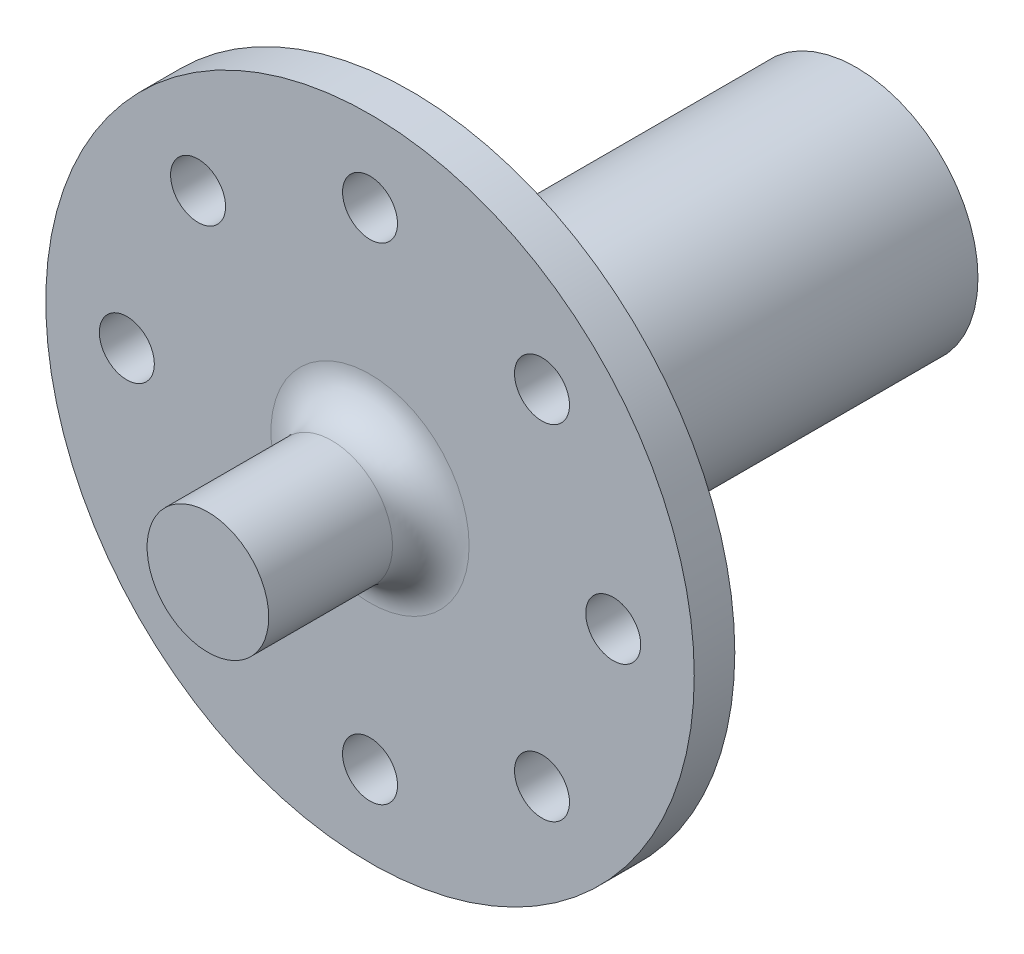
ISO-10303-21;
HEADER;
FILE_DESCRIPTION(('STEP AP214'),'2;1');
FILE_NAME('part.step','',(''),(''),'','','');
FILE_SCHEMA(('AUTOMOTIVE_DESIGN { 1 0 10303 214 1 1 1 1 }'));
ENDSEC;
DATA;
#1=APPLICATION_CONTEXT('core data for automotive mechanical design processes');
#2=APPLICATION_PROTOCOL_DEFINITION('international standard','automotive_design',2000,#1);
#3=PRODUCT_CONTEXT('',#1,'mechanical');
#4=PRODUCT('Part','Part','',(#3));
#5=PRODUCT_RELATED_PRODUCT_CATEGORY('part','',(#4));
#6=PRODUCT_DEFINITION_FORMATION('','',#4);
#7=PRODUCT_DEFINITION_CONTEXT('part definition',#1,'design');
#8=PRODUCT_DEFINITION('design','',#6,#7);
#9=PRODUCT_DEFINITION_SHAPE('','',#8);
#10=(LENGTH_UNIT() NAMED_UNIT(*) SI_UNIT(.MILLI.,.METRE.));
#11=(NAMED_UNIT(*) PLANE_ANGLE_UNIT() SI_UNIT($,.RADIAN.));
#12=(NAMED_UNIT(*) SI_UNIT($,.STERADIAN.) SOLID_ANGLE_UNIT());
#13=UNCERTAINTY_MEASURE_WITH_UNIT(LENGTH_MEASURE(1.E-05),#10,'distance_accuracy_value','');
#14=(GEOMETRIC_REPRESENTATION_CONTEXT(3) GLOBAL_UNCERTAINTY_ASSIGNED_CONTEXT((#13)) GLOBAL_UNIT_ASSIGNED_CONTEXT((#10,
#11,#12)) REPRESENTATION_CONTEXT('',''));
#15=CARTESIAN_POINT('',(0.,0.,0.));
#16=DIRECTION('',(0.,0.,1.));
#17=DIRECTION('',(1.,0.,0.));
#18=AXIS2_PLACEMENT_3D('',#15,#16,#17);
#19=CARTESIAN_POINT('',(0.,0.,34.925));
#20=DIRECTION('',(0.,0.,-1.));
#21=DIRECTION('',(-1.,0.,0.));
#22=AXIS2_PLACEMENT_3D('',#19,#20,#21);
#23=CYLINDRICAL_SURFACE('',#22,9.525);
#24=CARTESIAN_POINT('',(0.,0.,34.925));
#25=DIRECTION('',(0.,0.,1.));
#26=DIRECTION('',(1.,0.,0.));
#27=AXIS2_PLACEMENT_3D('',#24,#25,#26);
#28=CIRCLE('',#27,9.525);
#29=CARTESIAN_POINT('',(9.525,0.,34.925));
#30=VERTEX_POINT('',#29);
#31=EDGE_CURVE('E164',#30,#30,#28,.T.);
#32=ORIENTED_EDGE('',*,*,#31,.F.);
#33=EDGE_LOOP('',(#32));
#34=FACE_BOUND('',#33,.T.);
#35=CARTESIAN_POINT('',(0.,0.,0.));
#36=DIRECTION('',(0.,0.,1.));
#37=DIRECTION('',(1.,0.,0.));
#38=AXIS2_PLACEMENT_3D('',#35,#36,#37);
#39=CIRCLE('',#38,9.525);
#40=CARTESIAN_POINT('',(9.525,0.,0.));
#41=VERTEX_POINT('',#40);
#42=EDGE_CURVE('E161',#41,#41,#39,.T.);
#43=ORIENTED_EDGE('',*,*,#42,.T.);
#44=EDGE_LOOP('',(#43));
#45=FACE_BOUND('',#44,.T.);
#46=ADVANCED_FACE('F49',(#34,#45),#23,.T.);
#47=CARTESIAN_POINT('',(0.,0.,0.));
#48=DIRECTION('',(0.,0.,1.));
#49=DIRECTION('',(1.,0.,0.));
#50=AXIS2_PLACEMENT_3D('',#47,#48,#49);
#51=PLANE('',#50);
#52=CARTESIAN_POINT('',(0.,0.,0.));
#53=DIRECTION('',(0.,0.,-1.));
#54=DIRECTION('',(-1.,0.,0.));
#55=AXIS2_PLACEMENT_3D('',#52,#53,#54);
#56=CIRCLE('',#55,4.);
#57=CARTESIAN_POINT('',(1.5,3.70809924354783,0.));
#58=VERTEX_POINT('',#57);
#59=CARTESIAN_POINT('',(-1.5,3.70809924354783,0.));
#60=VERTEX_POINT('',#59);
#61=EDGE_CURVE('E99',#58,#60,#56,.T.);
#62=ORIENTED_EDGE('',*,*,#61,.F.);
#63=DIRECTION('',(0.,-1.,0.));
#64=VECTOR('',#63,1.);
#65=CARTESIAN_POINT('',(1.5,5.2,0.));
#66=LINE('',#65,#64);
#67=CARTESIAN_POINT('',(1.5,5.2,0.));
#68=VERTEX_POINT('',#67);
#69=EDGE_CURVE('E64',#68,#58,#66,.T.);
#70=ORIENTED_EDGE('',*,*,#69,.F.);
#71=DIRECTION('',(1.,0.,0.));
#72=VECTOR('',#71,1.);
#73=CARTESIAN_POINT('',(1.5,5.2,0.));
#74=LINE('',#73,#72);
#75=CARTESIAN_POINT('',(-1.5,5.2,0.));
#76=VERTEX_POINT('',#75);
#77=EDGE_CURVE('E115',#76,#68,#74,.T.);
#78=ORIENTED_EDGE('',*,*,#77,.F.);
#79=DIRECTION('',(0.,1.,0.));
#80=VECTOR('',#79,1.);
#81=CARTESIAN_POINT('',(-1.5,5.2,0.));
#82=LINE('',#81,#80);
#83=EDGE_CURVE('E121',#60,#76,#82,.T.);
#84=ORIENTED_EDGE('',*,*,#83,.F.);
#85=EDGE_LOOP('',(#62,#70,#78,#84));
#86=FACE_BOUND('',#85,.T.);
#87=ORIENTED_EDGE('',*,*,#42,.F.);
#88=EDGE_LOOP('',(#87));
#89=FACE_BOUND('',#88,.T.);
#90=ADVANCED_FACE('F210',(#86,#89),#51,.F.);
#91=CARTESIAN_POINT('',(0.,0.,38.1));
#92=DIRECTION('',(0.,0.,-1.));
#93=DIRECTION('',(-1.,0.,0.));
#94=AXIS2_PLACEMENT_3D('',#91,#92,#93);
#95=CYLINDRICAL_SURFACE('',#94,25.4);
#96=CARTESIAN_POINT('',(0.,0.,38.1));
#97=DIRECTION('',(0.,0.,1.));
#98=DIRECTION('',(1.,0.,0.));
#99=AXIS2_PLACEMENT_3D('',#96,#97,#98);
#100=CIRCLE('',#99,25.4);
#101=CARTESIAN_POINT('',(25.4,0.,38.1));
#102=VERTEX_POINT('',#101);
#103=EDGE_CURVE('E158',#102,#102,#100,.T.);
#104=ORIENTED_EDGE('',*,*,#103,.F.);
#105=EDGE_LOOP('',(#104));
#106=FACE_BOUND('',#105,.T.);
#107=CARTESIAN_POINT('',(0.,0.,34.925));
#108=DIRECTION('',(0.,0.,1.));
#109=DIRECTION('',(1.,0.,0.));
#110=AXIS2_PLACEMENT_3D('',#107,#108,#109);
#111=CIRCLE('',#110,25.4);
#112=CARTESIAN_POINT('',(25.4,0.,34.925));
#113=VERTEX_POINT('',#112);
#114=EDGE_CURVE('E157',#113,#113,#111,.T.);
#115=ORIENTED_EDGE('',*,*,#114,.T.);
#116=EDGE_LOOP('',(#115));
#117=FACE_BOUND('',#116,.T.);
#118=ADVANCED_FACE('F215',(#106,#117),#95,.T.);
#119=CARTESIAN_POINT('',(0.,0.,38.1));
#120=DIRECTION('',(0.,0.,1.));
#121=DIRECTION('',(1.,0.,0.));
#122=AXIS2_PLACEMENT_3D('',#119,#120,#121);
#123=PLANE('',#122);
#124=CARTESIAN_POINT('',(0.,0.,38.1));
#125=DIRECTION('',(0.,0.,1.));
#126=DIRECTION('',(1.,0.,0.));
#127=AXIS2_PLACEMENT_3D('',#124,#125,#126);
#128=CIRCLE('',#127,7.7625);
#129=CARTESIAN_POINT('',(7.7625,0.,38.1));
#130=VERTEX_POINT('',#129);
#131=EDGE_CURVE('E13',#130,#130,#128,.F.);
#132=ORIENTED_EDGE('',*,*,#131,.T.);
#133=EDGE_LOOP('',(#132));
#134=FACE_BOUND('',#133,.T.);
#135=CARTESIAN_POINT('',(-19.05,0.,38.1));
#136=DIRECTION('',(0.,0.,1.));
#137=DIRECTION('',(0.,1.,0.));
#138=AXIS2_PLACEMENT_3D('',#135,#136,#137);
#139=CIRCLE('',#138,2.15265);
#140=CARTESIAN_POINT('',(-19.05,2.15264999999993,38.1));
#141=VERTEX_POINT('',#140);
#142=EDGE_CURVE('E134',#141,#141,#139,.T.);
#143=ORIENTED_EDGE('',*,*,#142,.F.);
#144=EDGE_LOOP('',(#143));
#145=FACE_BOUND('',#144,.T.);
#146=CARTESIAN_POINT('',(-13.4703841816037,-13.4703841816038,38.1));
#147=DIRECTION('',(0.,0.,1.));
#148=DIRECTION('',(-0.707106781186551,0.707106781186544,0.));
#149=AXIS2_PLACEMENT_3D('',#146,#147,#148);
#150=CIRCLE('',#149,2.15265);
#151=CARTESIAN_POINT('',(-14.9925375941249,-11.9482307690826,38.1));
#152=VERTEX_POINT('',#151);
#153=EDGE_CURVE('E138',#152,#152,#150,.T.);
#154=ORIENTED_EDGE('',*,*,#153,.F.);
#155=EDGE_LOOP('',(#154));
#156=FACE_BOUND('',#155,.T.);
#157=CARTESIAN_POINT('',(0.,-19.05,38.1));
#158=DIRECTION('',(0.,0.,1.));
#159=DIRECTION('',(-1.,0.,0.));
#160=AXIS2_PLACEMENT_3D('',#157,#158,#159);
#161=CIRCLE('',#160,2.15265);
#162=CARTESIAN_POINT('',(-2.15265,-19.05,38.1));
#163=VERTEX_POINT('',#162);
#164=EDGE_CURVE('E141',#163,#163,#161,.T.);
#165=ORIENTED_EDGE('',*,*,#164,.F.);
#166=EDGE_LOOP('',(#165));
#167=FACE_BOUND('',#166,.T.);
#168=CARTESIAN_POINT('',(13.4703841816038,-13.4703841816036,38.1));
#169=DIRECTION('',(0.,0.,1.));
#170=DIRECTION('',(-0.707106781186541,-0.707106781186554,0.));
#171=AXIS2_PLACEMENT_3D('',#168,#169,#170);
#172=CIRCLE('',#171,2.15265);
#173=CARTESIAN_POINT('',(11.9482307690826,-14.9925375941248,38.1));
#174=VERTEX_POINT('',#173);
#175=EDGE_CURVE('E131',#174,#174,#172,.T.);
#176=ORIENTED_EDGE('',*,*,#175,.F.);
#177=EDGE_LOOP('',(#176));
#178=FACE_BOUND('',#177,.T.);
#179=CARTESIAN_POINT('',(19.05,1.99538158514885E-13,38.1));
#180=DIRECTION('',(0.,0.,1.));
#181=DIRECTION('',(0.,-1.,0.));
#182=AXIS2_PLACEMENT_3D('',#179,#180,#181);
#183=CIRCLE('',#182,2.15265);
#184=CARTESIAN_POINT('',(19.05,-2.1526499999998,38.1));
#185=VERTEX_POINT('',#184);
#186=EDGE_CURVE('E128',#185,#185,#183,.T.);
#187=ORIENTED_EDGE('',*,*,#186,.F.);
#188=EDGE_LOOP('',(#187));
#189=FACE_BOUND('',#188,.T.);
#190=CARTESIAN_POINT('',(13.4703841816036,13.4703841816039,38.1));
#191=DIRECTION('',(0.,0.,1.));
#192=DIRECTION('',(0.707106781186556,-0.707106781186539,0.));
#193=AXIS2_PLACEMENT_3D('',#190,#191,#192);
#194=CIRCLE('',#193,2.15265);
#195=CARTESIAN_POINT('',(14.9925375941248,11.9482307690827,38.1));
#196=VERTEX_POINT('',#195);
#197=EDGE_CURVE('E125',#196,#196,#194,.T.);
#198=ORIENTED_EDGE('',*,*,#197,.F.);
#199=EDGE_LOOP('',(#198));
#200=FACE_BOUND('',#199,.T.);
#201=CARTESIAN_POINT('',(-13.4703841816038,13.4703841816037,38.1));
#202=DIRECTION('',(0.,0.,1.));
#203=DIRECTION('',(0.707106781186546,0.707106781186549,0.));
#204=AXIS2_PLACEMENT_3D('',#201,#202,#203);
#205=CIRCLE('',#204,2.15265);
#206=CARTESIAN_POINT('',(-11.9482307690825,14.9925375941249,38.1));
#207=VERTEX_POINT('',#206);
#208=EDGE_CURVE('E137',#207,#207,#205,.T.);
#209=ORIENTED_EDGE('',*,*,#208,.F.);
#210=EDGE_LOOP('',(#209));
#211=FACE_BOUND('',#210,.T.);
#212=CARTESIAN_POINT('',(0.,19.05,38.1));
#213=DIRECTION('',(0.,0.,1.));
#214=DIRECTION('',(1.,0.,0.));
#215=AXIS2_PLACEMENT_3D('',#212,#213,#214);
#216=CIRCLE('',#215,2.15265);
#217=CARTESIAN_POINT('',(2.15265,19.05,38.1));
#218=VERTEX_POINT('',#217);
#219=EDGE_CURVE('E149',#218,#218,#216,.T.);
#220=ORIENTED_EDGE('',*,*,#219,.F.);
#221=EDGE_LOOP('',(#220));
#222=FACE_BOUND('',#221,.T.);
#223=ORIENTED_EDGE('',*,*,#103,.T.);
#224=EDGE_LOOP('',(#223));
#225=FACE_BOUND('',#224,.T.);
#226=ADVANCED_FACE('F223',(#134,#145,#156,#167,#178,#189,#200,#211,#222,#225),#123,.T.);
#227=CARTESIAN_POINT('',(0.,0.,34.925));
#228=DIRECTION('',(0.,0.,1.));
#229=DIRECTION('',(1.,0.,0.));
#230=AXIS2_PLACEMENT_3D('',#227,#228,#229);
#231=PLANE('',#230);
#232=CARTESIAN_POINT('',(-19.05,0.,34.925));
#233=DIRECTION('',(0.,0.,1.));
#234=DIRECTION('',(1.,0.,0.));
#235=AXIS2_PLACEMENT_3D('',#232,#233,#234);
#236=CIRCLE('',#235,2.15265);
#237=CARTESIAN_POINT('',(-16.89735,0.,34.925));
#238=VERTEX_POINT('',#237);
#239=EDGE_CURVE('E153',#238,#238,#236,.T.);
#240=ORIENTED_EDGE('',*,*,#239,.T.);
#241=EDGE_LOOP('',(#240));
#242=FACE_BOUND('',#241,.T.);
#243=CARTESIAN_POINT('',(-13.4703841816037,-13.4703841816038,34.925));
#244=DIRECTION('',(0.,0.,1.));
#245=DIRECTION('',(1.,0.,0.));
#246=AXIS2_PLACEMENT_3D('',#243,#244,#245);
#247=CIRCLE('',#246,2.15265);
#248=CARTESIAN_POINT('',(-11.3177341816037,-13.4703841816038,34.925));
#249=VERTEX_POINT('',#248);
#250=EDGE_CURVE('E185',#249,#249,#247,.T.);
#251=ORIENTED_EDGE('',*,*,#250,.T.);
#252=EDGE_LOOP('',(#251));
#253=FACE_BOUND('',#252,.T.);
#254=CARTESIAN_POINT('',(0.,-19.05,34.925));
#255=DIRECTION('',(0.,0.,1.));
#256=DIRECTION('',(1.,0.,0.));
#257=AXIS2_PLACEMENT_3D('',#254,#255,#256);
#258=CIRCLE('',#257,2.15265);
#259=CARTESIAN_POINT('',(2.15265,-19.05,34.925));
#260=VERTEX_POINT('',#259);
#261=EDGE_CURVE('E182',#260,#260,#258,.T.);
#262=ORIENTED_EDGE('',*,*,#261,.T.);
#263=EDGE_LOOP('',(#262));
#264=FACE_BOUND('',#263,.T.);
#265=CARTESIAN_POINT('',(13.4703841816038,-13.4703841816036,34.925));
#266=DIRECTION('',(0.,0.,1.));
#267=DIRECTION('',(1.,0.,0.));
#268=AXIS2_PLACEMENT_3D('',#265,#266,#267);
#269=CIRCLE('',#268,2.15265);
#270=CARTESIAN_POINT('',(15.6230341816038,-13.4703841816036,34.925));
#271=VERTEX_POINT('',#270);
#272=EDGE_CURVE('E179',#271,#271,#269,.T.);
#273=ORIENTED_EDGE('',*,*,#272,.T.);
#274=EDGE_LOOP('',(#273));
#275=FACE_BOUND('',#274,.T.);
#276=CARTESIAN_POINT('',(19.05,1.99538158514885E-13,34.925));
#277=DIRECTION('',(0.,0.,1.));
#278=DIRECTION('',(1.,0.,0.));
#279=AXIS2_PLACEMENT_3D('',#276,#277,#278);
#280=CIRCLE('',#279,2.15265);
#281=CARTESIAN_POINT('',(21.20265,1.99538158514885E-13,34.925));
#282=VERTEX_POINT('',#281);
#283=EDGE_CURVE('E176',#282,#282,#280,.T.);
#284=ORIENTED_EDGE('',*,*,#283,.T.);
#285=EDGE_LOOP('',(#284));
#286=FACE_BOUND('',#285,.T.);
#287=CARTESIAN_POINT('',(13.4703841816036,13.4703841816039,34.925));
#288=DIRECTION('',(0.,0.,1.));
#289=DIRECTION('',(1.,0.,0.));
#290=AXIS2_PLACEMENT_3D('',#287,#288,#289);
#291=CIRCLE('',#290,2.15265);
#292=CARTESIAN_POINT('',(15.6230341816036,13.4703841816039,34.925));
#293=VERTEX_POINT('',#292);
#294=EDGE_CURVE('E173',#293,#293,#291,.T.);
#295=ORIENTED_EDGE('',*,*,#294,.T.);
#296=EDGE_LOOP('',(#295));
#297=FACE_BOUND('',#296,.T.);
#298=CARTESIAN_POINT('',(-13.4703841816038,13.4703841816037,34.925));
#299=DIRECTION('',(0.,0.,1.));
#300=DIRECTION('',(1.,0.,0.));
#301=AXIS2_PLACEMENT_3D('',#298,#299,#300);
#302=CIRCLE('',#301,2.15265);
#303=CARTESIAN_POINT('',(-11.3177341816038,13.4703841816037,34.925));
#304=VERTEX_POINT('',#303);
#305=EDGE_CURVE('E148',#304,#304,#302,.T.);
#306=ORIENTED_EDGE('',*,*,#305,.T.);
#307=EDGE_LOOP('',(#306));
#308=FACE_BOUND('',#307,.T.);
#309=CARTESIAN_POINT('',(0.,19.05,34.925));
#310=DIRECTION('',(0.,0.,1.));
#311=DIRECTION('',(1.,0.,0.));
#312=AXIS2_PLACEMENT_3D('',#309,#310,#311);
#313=CIRCLE('',#312,2.15265);
#314=CARTESIAN_POINT('',(2.15265,19.05,34.925));
#315=VERTEX_POINT('',#314);
#316=EDGE_CURVE('E152',#315,#315,#313,.T.);
#317=ORIENTED_EDGE('',*,*,#316,.T.);
#318=EDGE_LOOP('',(#317));
#319=FACE_BOUND('',#318,.T.);
#320=ORIENTED_EDGE('',*,*,#31,.T.);
#321=EDGE_LOOP('',(#320));
#322=FACE_BOUND('',#321,.T.);
#323=ORIENTED_EDGE('',*,*,#114,.F.);
#324=EDGE_LOOP('',(#323));
#325=FACE_BOUND('',#324,.T.);
#326=ADVANCED_FACE('F225',(#242,#253,#264,#275,#286,#297,#308,#319,#322,#325),#231,.F.);
#327=CARTESIAN_POINT('',(0.,0.,50.8));
#328=DIRECTION('',(0.,0.,-1.));
#329=DIRECTION('',(-1.,0.,0.));
#330=AXIS2_PLACEMENT_3D('',#327,#328,#329);
#331=CYLINDRICAL_SURFACE('',#330,4.7625);
#332=CARTESIAN_POINT('',(0.,0.,41.1));
#333=DIRECTION('',(0.,0.,1.));
#334=DIRECTION('',(1.,0.,0.));
#335=AXIS2_PLACEMENT_3D('',#332,#333,#334);
#336=CIRCLE('',#335,4.7625);
#337=CARTESIAN_POINT('',(4.7625,0.,41.1));
#338=VERTEX_POINT('',#337);
#339=EDGE_CURVE('E57',#338,#338,#336,.T.);
#340=ORIENTED_EDGE('',*,*,#339,.T.);
#341=EDGE_LOOP('',(#340));
#342=FACE_BOUND('',#341,.T.);
#343=CARTESIAN_POINT('',(0.,0.,50.8));
#344=DIRECTION('',(0.,0.,1.));
#345=DIRECTION('',(1.,0.,0.));
#346=AXIS2_PLACEMENT_3D('',#343,#344,#345);
#347=CIRCLE('',#346,4.7625);
#348=CARTESIAN_POINT('',(4.7625,0.,50.8));
#349=VERTEX_POINT('',#348);
#350=EDGE_CURVE('E154',#349,#349,#347,.T.);
#351=ORIENTED_EDGE('',*,*,#350,.F.);
#352=EDGE_LOOP('',(#351));
#353=FACE_BOUND('',#352,.T.);
#354=ADVANCED_FACE('F192',(#342,#353),#331,.T.);
#355=CARTESIAN_POINT('',(0.,0.,50.8));
#356=DIRECTION('',(0.,0.,1.));
#357=DIRECTION('',(1.,0.,0.));
#358=AXIS2_PLACEMENT_3D('',#355,#356,#357);
#359=PLANE('',#358);
#360=ORIENTED_EDGE('',*,*,#350,.T.);
#361=EDGE_LOOP('',(#360));
#362=FACE_BOUND('',#361,.T.);
#363=ADVANCED_FACE('F234',(#362),#359,.T.);
#364=CARTESIAN_POINT('',(0.,19.05,19.05));
#365=DIRECTION('',(0.,0.,1.));
#366=DIRECTION('',(1.,0.,0.));
#367=AXIS2_PLACEMENT_3D('',#364,#365,#366);
#368=CYLINDRICAL_SURFACE('',#367,2.15265);
#369=ORIENTED_EDGE('',*,*,#219,.T.);
#370=EDGE_LOOP('',(#369));
#371=FACE_BOUND('',#370,.T.);
#372=ORIENTED_EDGE('',*,*,#316,.F.);
#373=EDGE_LOOP('',(#372));
#374=FACE_BOUND('',#373,.T.);
#375=ADVANCED_FACE('F237',(#371,#374),#368,.F.);
#376=CARTESIAN_POINT('',(-13.4703841816038,13.4703841816037,19.05));
#377=DIRECTION('',(0.,0.,1.));
#378=DIRECTION('',(1.,0.,0.));
#379=AXIS2_PLACEMENT_3D('',#376,#377,#378);
#380=CYLINDRICAL_SURFACE('',#379,2.15265);
#381=ORIENTED_EDGE('',*,*,#208,.T.);
#382=EDGE_LOOP('',(#381));
#383=FACE_BOUND('',#382,.T.);
#384=ORIENTED_EDGE('',*,*,#305,.F.);
#385=EDGE_LOOP('',(#384));
#386=FACE_BOUND('',#385,.T.);
#387=ADVANCED_FACE('F241',(#383,#386),#380,.F.);
#388=CARTESIAN_POINT('',(13.4703841816036,13.4703841816039,19.05));
#389=DIRECTION('',(0.,0.,1.));
#390=DIRECTION('',(1.,0.,0.));
#391=AXIS2_PLACEMENT_3D('',#388,#389,#390);
#392=CYLINDRICAL_SURFACE('',#391,2.15265);
#393=ORIENTED_EDGE('',*,*,#197,.T.);
#394=EDGE_LOOP('',(#393));
#395=FACE_BOUND('',#394,.T.);
#396=ORIENTED_EDGE('',*,*,#294,.F.);
#397=EDGE_LOOP('',(#396));
#398=FACE_BOUND('',#397,.T.);
#399=ADVANCED_FACE('F245',(#395,#398),#392,.F.);
#400=CARTESIAN_POINT('',(19.05,1.99538158514885E-13,19.05));
#401=DIRECTION('',(0.,0.,1.));
#402=DIRECTION('',(1.,0.,0.));
#403=AXIS2_PLACEMENT_3D('',#400,#401,#402);
#404=CYLINDRICAL_SURFACE('',#403,2.15265);
#405=ORIENTED_EDGE('',*,*,#186,.T.);
#406=EDGE_LOOP('',(#405));
#407=FACE_BOUND('',#406,.T.);
#408=ORIENTED_EDGE('',*,*,#283,.F.);
#409=EDGE_LOOP('',(#408));
#410=FACE_BOUND('',#409,.T.);
#411=ADVANCED_FACE('F251',(#407,#410),#404,.F.);
#412=CARTESIAN_POINT('',(13.4703841816038,-13.4703841816036,19.05));
#413=DIRECTION('',(0.,0.,1.));
#414=DIRECTION('',(1.,0.,0.));
#415=AXIS2_PLACEMENT_3D('',#412,#413,#414);
#416=CYLINDRICAL_SURFACE('',#415,2.15265);
#417=ORIENTED_EDGE('',*,*,#175,.T.);
#418=EDGE_LOOP('',(#417));
#419=FACE_BOUND('',#418,.T.);
#420=ORIENTED_EDGE('',*,*,#272,.F.);
#421=EDGE_LOOP('',(#420));
#422=FACE_BOUND('',#421,.T.);
#423=ADVANCED_FACE('F247',(#419,#422),#416,.F.);
#424=CARTESIAN_POINT('',(0.,-19.05,19.05));
#425=DIRECTION('',(0.,0.,1.));
#426=DIRECTION('',(1.,0.,0.));
#427=AXIS2_PLACEMENT_3D('',#424,#425,#426);
#428=CYLINDRICAL_SURFACE('',#427,2.15265);
#429=ORIENTED_EDGE('',*,*,#164,.T.);
#430=EDGE_LOOP('',(#429));
#431=FACE_BOUND('',#430,.T.);
#432=ORIENTED_EDGE('',*,*,#261,.F.);
#433=EDGE_LOOP('',(#432));
#434=FACE_BOUND('',#433,.T.);
#435=ADVANCED_FACE('F250',(#431,#434),#428,.F.);
#436=CARTESIAN_POINT('',(-13.4703841816037,-13.4703841816038,19.05));
#437=DIRECTION('',(0.,0.,1.));
#438=DIRECTION('',(1.,0.,0.));
#439=AXIS2_PLACEMENT_3D('',#436,#437,#438);
#440=CYLINDRICAL_SURFACE('',#439,2.15265);
#441=ORIENTED_EDGE('',*,*,#153,.T.);
#442=EDGE_LOOP('',(#441));
#443=FACE_BOUND('',#442,.T.);
#444=ORIENTED_EDGE('',*,*,#250,.F.);
#445=EDGE_LOOP('',(#444));
#446=FACE_BOUND('',#445,.T.);
#447=ADVANCED_FACE('F205',(#443,#446),#440,.F.);
#448=CARTESIAN_POINT('',(-19.05,0.,19.05));
#449=DIRECTION('',(0.,0.,1.));
#450=DIRECTION('',(1.,0.,0.));
#451=AXIS2_PLACEMENT_3D('',#448,#449,#450);
#452=CYLINDRICAL_SURFACE('',#451,2.15265);
#453=ORIENTED_EDGE('',*,*,#142,.T.);
#454=EDGE_LOOP('',(#453));
#455=FACE_BOUND('',#454,.T.);
#456=ORIENTED_EDGE('',*,*,#239,.F.);
#457=EDGE_LOOP('',(#456));
#458=FACE_BOUND('',#457,.T.);
#459=ADVANCED_FACE('F197',(#455,#458),#452,.F.);
#460=CARTESIAN_POINT('',(0.,0.,41.1));
#461=DIRECTION('',(0.,0.,1.));
#462=DIRECTION('',(1.,0.,0.));
#463=AXIS2_PLACEMENT_3D('',#460,#461,#462);
#464=TOROIDAL_SURFACE('',#463,7.7625,3.);
#465=ORIENTED_EDGE('',*,*,#131,.F.);
#466=EDGE_LOOP('',(#465));
#467=FACE_BOUND('',#466,.T.);
#468=ORIENTED_EDGE('',*,*,#339,.F.);
#469=EDGE_LOOP('',(#468));
#470=FACE_BOUND('',#469,.T.);
#471=ADVANCED_FACE('F51',(#467,#470),#464,.F.);
#472=CARTESIAN_POINT('',(1.5,5.2,17.1500038));
#473=DIRECTION('',(1.,0.,0.));
#474=DIRECTION('',(0.,1.,0.));
#475=AXIS2_PLACEMENT_3D('',#472,#473,#474);
#476=PLANE('',#475);
#477=ORIENTED_EDGE('',*,*,#69,.T.);
#478=DIRECTION('',(0.,0.,-1.));
#479=VECTOR('',#478,1.);
#480=CARTESIAN_POINT('',(1.5,3.70809924354783,17.1500038));
#481=LINE('',#480,#479);
#482=CARTESIAN_POINT('',(1.5,3.70809924354783,17.1500038));
#483=VERTEX_POINT('',#482);
#484=EDGE_CURVE('E87',#483,#58,#481,.T.);
#485=ORIENTED_EDGE('',*,*,#484,.F.);
#486=DIRECTION('',(0.,-1.,0.));
#487=VECTOR('',#486,1.);
#488=CARTESIAN_POINT('',(1.5,5.2,17.1500038));
#489=LINE('',#488,#487);
#490=CARTESIAN_POINT('',(1.5,5.2,17.1500038));
#491=VERTEX_POINT('',#490);
#492=EDGE_CURVE('E113',#491,#483,#489,.T.);
#493=ORIENTED_EDGE('',*,*,#492,.F.);
#494=DIRECTION('',(0.,0.,-1.));
#495=VECTOR('',#494,1.);
#496=CARTESIAN_POINT('',(1.5,5.2,17.1500038));
#497=LINE('',#496,#495);
#498=EDGE_CURVE('E72',#491,#68,#497,.T.);
#499=ORIENTED_EDGE('',*,*,#498,.T.);
#500=EDGE_LOOP('',(#477,#485,#493,#499));
#501=FACE_BOUND('',#500,.T.);
#502=ADVANCED_FACE('F196',(#501),#476,.F.);
#503=CARTESIAN_POINT('',(1.5,5.2,17.1500038));
#504=DIRECTION('',(0.,1.,0.));
#505=DIRECTION('',(0.,0.,1.));
#506=AXIS2_PLACEMENT_3D('',#503,#504,#505);
#507=PLANE('',#506);
#508=ORIENTED_EDGE('',*,*,#77,.T.);
#509=ORIENTED_EDGE('',*,*,#498,.F.);
#510=DIRECTION('',(1.,0.,0.));
#511=VECTOR('',#510,1.);
#512=CARTESIAN_POINT('',(1.5,5.2,17.1500038));
#513=LINE('',#512,#511);
#514=CARTESIAN_POINT('',(-1.5,5.2,17.1500038));
#515=VERTEX_POINT('',#514);
#516=EDGE_CURVE('E110',#515,#491,#513,.T.);
#517=ORIENTED_EDGE('',*,*,#516,.F.);
#518=DIRECTION('',(0.,0.,-1.));
#519=VECTOR('',#518,1.);
#520=CARTESIAN_POINT('',(-1.5,5.2,17.1500038));
#521=LINE('',#520,#519);
#522=EDGE_CURVE('E103',#515,#76,#521,.T.);
#523=ORIENTED_EDGE('',*,*,#522,.T.);
#524=EDGE_LOOP('',(#508,#509,#517,#523));
#525=FACE_BOUND('',#524,.T.);
#526=ADVANCED_FACE('F203',(#525),#507,.F.);
#527=CARTESIAN_POINT('',(-1.5,5.2,17.1500038));
#528=DIRECTION('',(-1.,0.,0.));
#529=DIRECTION('',(0.,-1.,0.));
#530=AXIS2_PLACEMENT_3D('',#527,#528,#529);
#531=PLANE('',#530);
#532=ORIENTED_EDGE('',*,*,#83,.T.);
#533=ORIENTED_EDGE('',*,*,#522,.F.);
#534=DIRECTION('',(0.,1.,0.));
#535=VECTOR('',#534,1.);
#536=CARTESIAN_POINT('',(-1.5,5.2,17.1500038));
#537=LINE('',#536,#535);
#538=CARTESIAN_POINT('',(-1.5,3.70809924354783,17.1500038));
#539=VERTEX_POINT('',#538);
#540=EDGE_CURVE('E106',#539,#515,#537,.T.);
#541=ORIENTED_EDGE('',*,*,#540,.F.);
#542=DIRECTION('',(0.,0.,-1.));
#543=VECTOR('',#542,1.);
#544=CARTESIAN_POINT('',(-1.5,3.70809924354783,17.1500038));
#545=LINE('',#544,#543);
#546=EDGE_CURVE('E92',#539,#60,#545,.T.);
#547=ORIENTED_EDGE('',*,*,#546,.T.);
#548=EDGE_LOOP('',(#532,#533,#541,#547));
#549=FACE_BOUND('',#548,.T.);
#550=ADVANCED_FACE('F107',(#549),#531,.F.);
#551=CARTESIAN_POINT('',(0.,0.,17.1500038));
#552=DIRECTION('',(0.,0.,-1.));
#553=DIRECTION('',(-1.,0.,0.));
#554=AXIS2_PLACEMENT_3D('',#551,#552,#553);
#555=CYLINDRICAL_SURFACE('',#554,4.);
#556=ORIENTED_EDGE('',*,*,#61,.T.);
#557=ORIENTED_EDGE('',*,*,#546,.F.);
#558=CARTESIAN_POINT('',(0.,0.,17.1500038));
#559=DIRECTION('',(0.,0.,-1.));
#560=DIRECTION('',(-1.,0.,0.));
#561=AXIS2_PLACEMENT_3D('',#558,#559,#560);
#562=CIRCLE('',#561,4.);
#563=EDGE_CURVE('E96',#483,#539,#562,.T.);
#564=ORIENTED_EDGE('',*,*,#563,.F.);
#565=ORIENTED_EDGE('',*,*,#484,.T.);
#566=EDGE_LOOP('',(#556,#557,#564,#565));
#567=FACE_BOUND('',#566,.T.);
#568=ADVANCED_FACE('F94',(#567),#555,.F.);
#569=CARTESIAN_POINT('',(0.,0.,17.1500038));
#570=DIRECTION('',(0.,0.,-1.));
#571=DIRECTION('',(-1.,0.,0.));
#572=AXIS2_PLACEMENT_3D('',#569,#570,#571);
#573=PLANE('',#572);
#574=ORIENTED_EDGE('',*,*,#492,.T.);
#575=ORIENTED_EDGE('',*,*,#563,.T.);
#576=ORIENTED_EDGE('',*,*,#540,.T.);
#577=ORIENTED_EDGE('',*,*,#516,.T.);
#578=EDGE_LOOP('',(#574,#575,#576,#577));
#579=FACE_BOUND('',#578,.T.);
#580=ADVANCED_FACE('F112',(#579),#573,.T.);
#581=CLOSED_SHELL('',(#46,#90,#118,#226,#326,#354,#363,#375,#387,#399,#411,#423,#435,#447,#459,
#471,#502,#526,#550,#568,#580));
#582=MANIFOLD_SOLID_BREP('B2',#581);
#583=ADVANCED_BREP_SHAPE_REPRESENTATION('',(#18,#582),#14);
#584=SHAPE_DEFINITION_REPRESENTATION(#9,#583);
ENDSEC;
END-ISO-10303-21;
